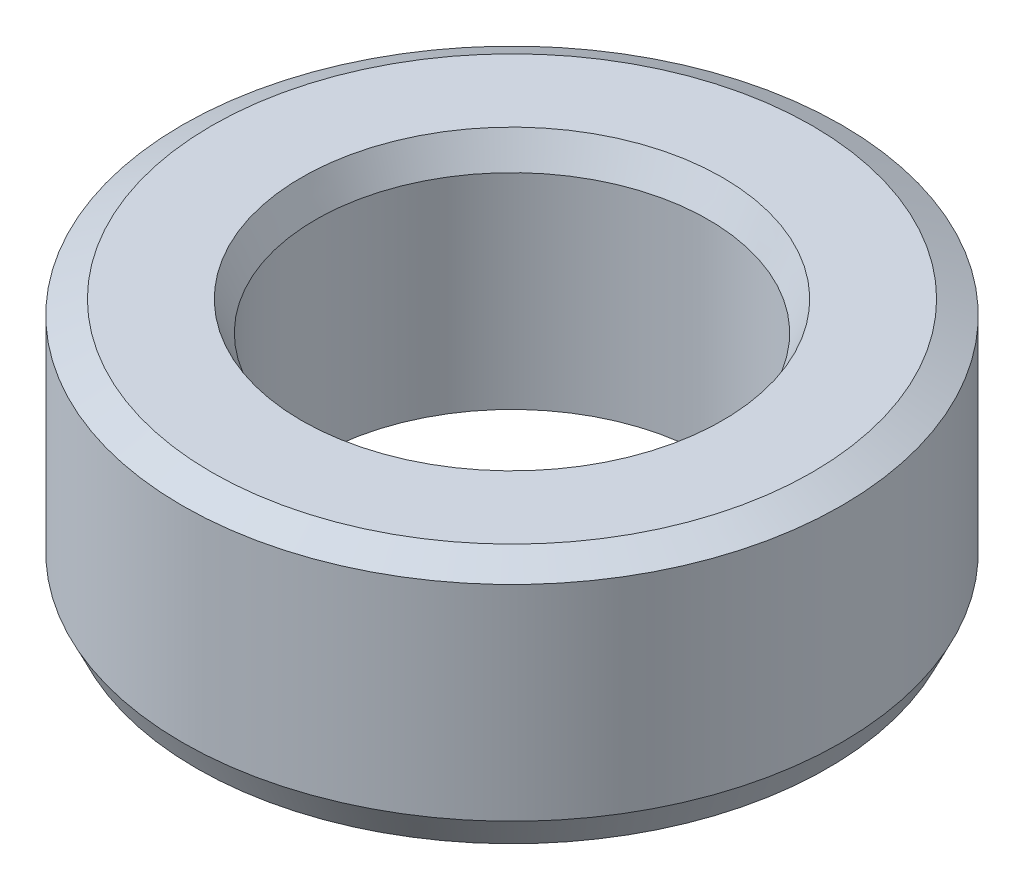
ISO-10303-21;
HEADER;
FILE_DESCRIPTION(('STEP AP214'),'2;1');
FILE_NAME('part.step','',(''),(''),'','','');
FILE_SCHEMA(('AUTOMOTIVE_DESIGN { 1 0 10303 214 1 1 1 1 }'));
ENDSEC;
DATA;
#1=APPLICATION_CONTEXT('core data for automotive mechanical design processes');
#2=APPLICATION_PROTOCOL_DEFINITION('international standard','automotive_design',2000,#1);
#3=PRODUCT_CONTEXT('',#1,'mechanical');
#4=PRODUCT('Part','Part','',(#3));
#5=PRODUCT_RELATED_PRODUCT_CATEGORY('part','',(#4));
#6=PRODUCT_DEFINITION_FORMATION('','',#4);
#7=PRODUCT_DEFINITION_CONTEXT('part definition',#1,'design');
#8=PRODUCT_DEFINITION('design','',#6,#7);
#9=PRODUCT_DEFINITION_SHAPE('','',#8);
#10=(LENGTH_UNIT() NAMED_UNIT(*) SI_UNIT(.MILLI.,.METRE.));
#11=(NAMED_UNIT(*) PLANE_ANGLE_UNIT() SI_UNIT($,.RADIAN.));
#12=(NAMED_UNIT(*) SI_UNIT($,.STERADIAN.) SOLID_ANGLE_UNIT());
#13=UNCERTAINTY_MEASURE_WITH_UNIT(LENGTH_MEASURE(1.E-05),#10,'distance_accuracy_value','');
#14=(GEOMETRIC_REPRESENTATION_CONTEXT(3) GLOBAL_UNCERTAINTY_ASSIGNED_CONTEXT((#13)) GLOBAL_UNIT_ASSIGNED_CONTEXT((#10,
#11,#12)) REPRESENTATION_CONTEXT('',''));
#15=CARTESIAN_POINT('',(0.,0.,0.));
#16=DIRECTION('',(0.,0.,1.));
#17=DIRECTION('',(1.,0.,0.));
#18=AXIS2_PLACEMENT_3D('',#15,#16,#17);
#19=CARTESIAN_POINT('',(0.,37.7098961493895,0.));
#20=DIRECTION('',(0.,-1.,0.));
#21=DIRECTION('',(0.,0.,-1.));
#22=AXIS2_PLACEMENT_3D('',#19,#20,#21);
#23=CYLINDRICAL_SURFACE('',#22,50.);
#24=CARTESIAN_POINT('',(0.,4.46577603132502,0.));
#25=DIRECTION('',(0.,1.,0.));
#26=DIRECTION('',(0.,0.,1.));
#27=AXIS2_PLACEMENT_3D('',#24,#25,#26);
#28=CIRCLE('',#27,50.);
#29=CARTESIAN_POINT('',(0.,4.46577603132502,50.));
#30=VERTEX_POINT('',#29);
#31=EDGE_CURVE('E10',#30,#30,#28,.T.);
#32=ORIENTED_EDGE('',*,*,#31,.T.);
#33=EDGE_LOOP('',(#32));
#34=FACE_BOUND('',#33,.T.);
#35=CARTESIAN_POINT('',(0.,35.5635196183231,0.));
#36=DIRECTION('',(0.,1.,0.));
#37=DIRECTION('',(0.,0.,1.));
#38=AXIS2_PLACEMENT_3D('',#35,#36,#37);
#39=CIRCLE('',#38,50.);
#40=CARTESIAN_POINT('',(0.,35.5635196183231,50.));
#41=VERTEX_POINT('',#40);
#42=EDGE_CURVE('E50',#41,#41,#39,.F.);
#43=ORIENTED_EDGE('',*,*,#42,.T.);
#44=EDGE_LOOP('',(#43));
#45=FACE_BOUND('',#44,.T.);
#46=ADVANCED_FACE('F39',(#34,#45),#23,.T.);
#47=CARTESIAN_POINT('',(0.,37.7098961493895,0.));
#48=DIRECTION('',(0.,1.,0.));
#49=DIRECTION('',(0.,0.,1.));
#50=AXIS2_PLACEMENT_3D('',#47,#48,#49);
#51=PLANE('',#50);
#52=CARTESIAN_POINT('',(0.,37.7098961493895,0.));
#53=DIRECTION('',(0.,1.,0.));
#54=DIRECTION('',(0.,0.,1.));
#55=AXIS2_PLACEMENT_3D('',#52,#53,#54);
#56=CIRCLE('',#55,31.9261798939814);
#57=CARTESIAN_POINT('',(0.,37.7098961493895,31.9261798939814));
#58=VERTEX_POINT('',#57);
#59=EDGE_CURVE('E58',#58,#58,#56,.F.);
#60=ORIENTED_EDGE('',*,*,#59,.T.);
#61=EDGE_LOOP('',(#60));
#62=FACE_BOUND('',#61,.T.);
#63=CARTESIAN_POINT('',(0.,37.7098961493895,0.));
#64=DIRECTION('',(0.,1.,0.));
#65=DIRECTION('',(0.,0.,1.));
#66=AXIS2_PLACEMENT_3D('',#63,#64,#65);
#67=CIRCLE('',#66,45.534223968675);
#68=CARTESIAN_POINT('',(0.,37.7098961493895,45.534223968675));
#69=VERTEX_POINT('',#68);
#70=EDGE_CURVE('E61',#69,#69,#67,.T.);
#71=ORIENTED_EDGE('',*,*,#70,.T.);
#72=EDGE_LOOP('',(#71));
#73=FACE_BOUND('',#72,.T.);
#74=ADVANCED_FACE('F88',(#62,#73),#51,.T.);
#75=CARTESIAN_POINT('',(0.,0.,0.));
#76=DIRECTION('',(0.,1.,0.));
#77=DIRECTION('',(0.,0.,1.));
#78=AXIS2_PLACEMENT_3D('',#75,#76,#77);
#79=PLANE('',#78);
#80=CARTESIAN_POINT('',(0.,0.,0.));
#81=DIRECTION('',(0.,1.,0.));
#82=DIRECTION('',(0.,0.,1.));
#83=AXIS2_PLACEMENT_3D('',#80,#81,#82);
#84=CIRCLE('',#83,34.24557939424);
#85=CARTESIAN_POINT('',(0.,0.,34.24557939424));
#86=VERTEX_POINT('',#85);
#87=EDGE_CURVE('E51',#86,#86,#84,.T.);
#88=ORIENTED_EDGE('',*,*,#87,.T.);
#89=EDGE_LOOP('',(#88));
#90=FACE_BOUND('',#89,.T.);
#91=CARTESIAN_POINT('',(0.,0.,0.));
#92=DIRECTION('',(0.,1.,0.));
#93=DIRECTION('',(0.,0.,1.));
#94=AXIS2_PLACEMENT_3D('',#91,#92,#93);
#95=CIRCLE('',#94,47.8536234689335);
#96=CARTESIAN_POINT('',(0.,0.,47.8536234689335));
#97=VERTEX_POINT('',#96);
#98=EDGE_CURVE('E54',#97,#97,#95,.F.);
#99=ORIENTED_EDGE('',*,*,#98,.T.);
#100=EDGE_LOOP('',(#99));
#101=FACE_BOUND('',#100,.T.);
#102=ADVANCED_FACE('F83',(#90,#101),#79,.F.);
#103=CARTESIAN_POINT('',(0.,37.7098961493895,0.));
#104=DIRECTION('',(0.,-1.,0.));
#105=DIRECTION('',(0.,0.,-1.));
#106=AXIS2_PLACEMENT_3D('',#103,#104,#105);
#107=CYLINDRICAL_SURFACE('',#106,29.779803362915);
#108=CARTESIAN_POINT('',(0.,33.2441201180645,0.));
#109=DIRECTION('',(0.,1.,0.));
#110=DIRECTION('',(0.,0.,1.));
#111=AXIS2_PLACEMENT_3D('',#108,#109,#110);
#112=CIRCLE('',#111,29.779803362915);
#113=CARTESIAN_POINT('',(0.,33.2441201180645,29.779803362915));
#114=VERTEX_POINT('',#113);
#115=EDGE_CURVE('E67',#114,#114,#112,.T.);
#116=ORIENTED_EDGE('',*,*,#115,.T.);
#117=EDGE_LOOP('',(#116));
#118=FACE_BOUND('',#117,.T.);
#119=CARTESIAN_POINT('',(0.,2.14637653106647,0.));
#120=DIRECTION('',(0.,1.,0.));
#121=DIRECTION('',(0.,0.,1.));
#122=AXIS2_PLACEMENT_3D('',#119,#120,#121);
#123=CIRCLE('',#122,29.779803362915);
#124=CARTESIAN_POINT('',(0.,2.14637653106647,29.779803362915));
#125=VERTEX_POINT('',#124);
#126=EDGE_CURVE('E69',#125,#125,#123,.F.);
#127=ORIENTED_EDGE('',*,*,#126,.T.);
#128=EDGE_LOOP('',(#127));
#129=FACE_BOUND('',#128,.T.);
#130=ADVANCED_FACE('F71',(#118,#129),#107,.F.);
#131=CARTESIAN_POINT('',(0.,33.2441201180645,0.));
#132=DIRECTION('',(0.,1.,0.));
#133=DIRECTION('',(0.,0.,1.));
#134=AXIS2_PLACEMENT_3D('',#131,#132,#133);
#135=CONICAL_SURFACE('',#134,29.779803362915,0.44803016748419);
#136=ORIENTED_EDGE('',*,*,#59,.F.);
#137=EDGE_LOOP('',(#136));
#138=FACE_BOUND('',#137,.T.);
#139=ORIENTED_EDGE('',*,*,#115,.F.);
#140=EDGE_LOOP('',(#139));
#141=FACE_BOUND('',#140,.T.);
#142=ADVANCED_FACE('F77',(#138,#141),#135,.F.);
#143=CARTESIAN_POINT('',(0.,0.,0.));
#144=DIRECTION('',(0.,-1.,0.));
#145=DIRECTION('',(0.,0.,-1.));
#146=AXIS2_PLACEMENT_3D('',#143,#144,#145);
#147=CONICAL_SURFACE('',#146,34.24557939424,1.1227661593107);
#148=ORIENTED_EDGE('',*,*,#126,.F.);
#149=EDGE_LOOP('',(#148));
#150=FACE_BOUND('',#149,.T.);
#151=ORIENTED_EDGE('',*,*,#87,.F.);
#152=EDGE_LOOP('',(#151));
#153=FACE_BOUND('',#152,.T.);
#154=ADVANCED_FACE('F73',(#150,#153),#147,.F.);
#155=CARTESIAN_POINT('',(0.,4.46577603132502,0.));
#156=DIRECTION('',(0.,1.,0.));
#157=DIRECTION('',(0.,0.,1.));
#158=AXIS2_PLACEMENT_3D('',#155,#156,#157);
#159=CONICAL_SURFACE('',#158,50.,0.44803016748419);
#160=ORIENTED_EDGE('',*,*,#98,.F.);
#161=EDGE_LOOP('',(#160));
#162=FACE_BOUND('',#161,.T.);
#163=ORIENTED_EDGE('',*,*,#31,.F.);
#164=EDGE_LOOP('',(#163));
#165=FACE_BOUND('',#164,.T.);
#166=ADVANCED_FACE('F76',(#162,#165),#159,.T.);
#167=CARTESIAN_POINT('',(0.,37.7098961493895,0.));
#168=DIRECTION('',(0.,-1.,0.));
#169=DIRECTION('',(0.,0.,-1.));
#170=AXIS2_PLACEMENT_3D('',#167,#168,#169);
#171=CONICAL_SURFACE('',#170,45.534223968675,1.1227661593107);
#172=ORIENTED_EDGE('',*,*,#42,.F.);
#173=EDGE_LOOP('',(#172));
#174=FACE_BOUND('',#173,.T.);
#175=ORIENTED_EDGE('',*,*,#70,.F.);
#176=EDGE_LOOP('',(#175));
#177=FACE_BOUND('',#176,.T.);
#178=ADVANCED_FACE('F45',(#174,#177),#171,.T.);
#179=CLOSED_SHELL('',(#46,#74,#102,#130,#142,#154,#166,#178));
#180=MANIFOLD_SOLID_BREP('B2',#179);
#181=ADVANCED_BREP_SHAPE_REPRESENTATION('',(#18,#180),#14);
#182=SHAPE_DEFINITION_REPRESENTATION(#9,#181);
ENDSEC;
END-ISO-10303-21;
